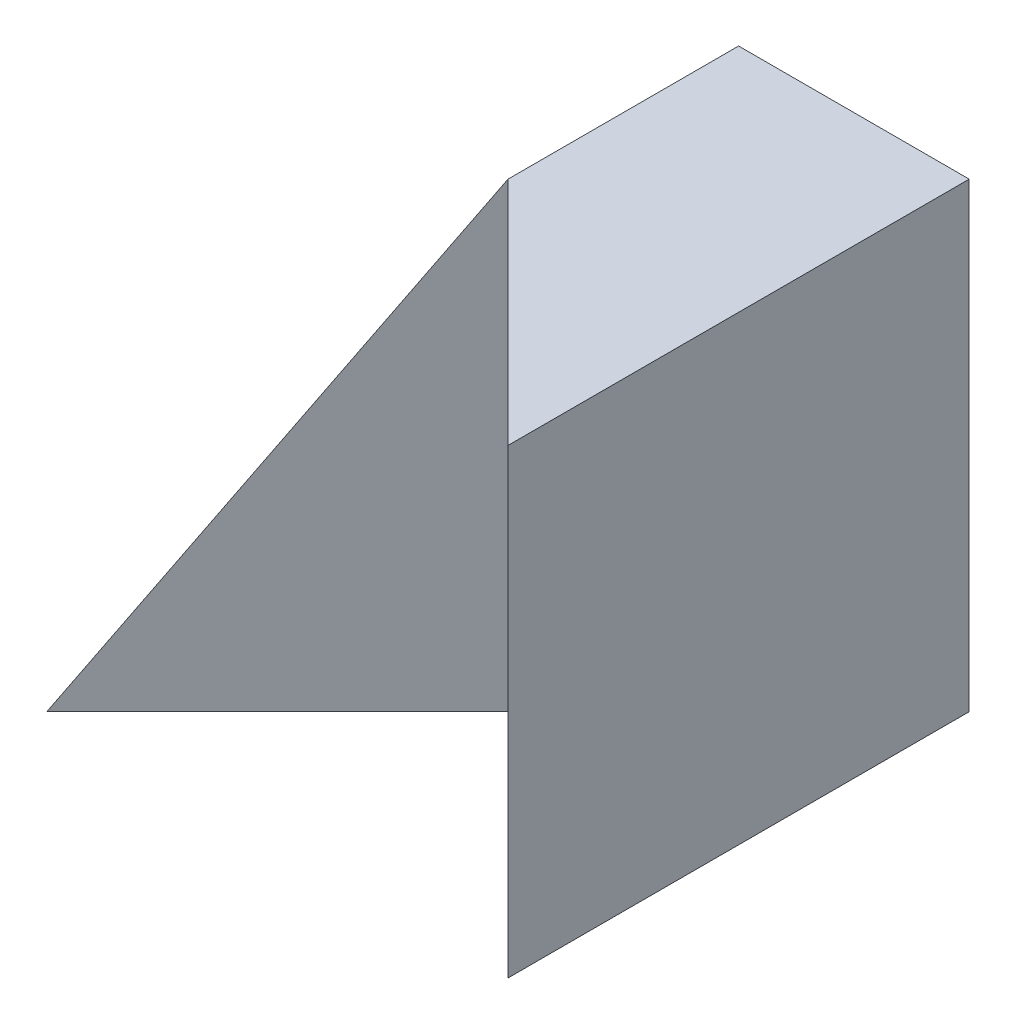
ISO-10303-21;
HEADER;
FILE_DESCRIPTION(('STEP AP214'),'2;1');
FILE_NAME('part.step','',(''),(''),'','','');
FILE_SCHEMA(('AUTOMOTIVE_DESIGN { 1 0 10303 214 1 1 1 1 }'));
ENDSEC;
DATA;
#1=APPLICATION_CONTEXT('core data for automotive mechanical design processes');
#2=APPLICATION_PROTOCOL_DEFINITION('international standard','automotive_design',2000,#1);
#3=PRODUCT_CONTEXT('',#1,'mechanical');
#4=PRODUCT('Part','Part','',(#3));
#5=PRODUCT_RELATED_PRODUCT_CATEGORY('part','',(#4));
#6=PRODUCT_DEFINITION_FORMATION('','',#4);
#7=PRODUCT_DEFINITION_CONTEXT('part definition',#1,'design');
#8=PRODUCT_DEFINITION('design','',#6,#7);
#9=PRODUCT_DEFINITION_SHAPE('','',#8);
#10=(LENGTH_UNIT() NAMED_UNIT(*) SI_UNIT(.MILLI.,.METRE.));
#11=(NAMED_UNIT(*) PLANE_ANGLE_UNIT() SI_UNIT($,.RADIAN.));
#12=(NAMED_UNIT(*) SI_UNIT($,.STERADIAN.) SOLID_ANGLE_UNIT());
#13=UNCERTAINTY_MEASURE_WITH_UNIT(LENGTH_MEASURE(1.E-05),#10,'distance_accuracy_value','');
#14=(GEOMETRIC_REPRESENTATION_CONTEXT(3) GLOBAL_UNCERTAINTY_ASSIGNED_CONTEXT((#13)) GLOBAL_UNIT_ASSIGNED_CONTEXT((#10,
#11,#12)) REPRESENTATION_CONTEXT('',''));
#15=CARTESIAN_POINT('',(0.,0.,0.));
#16=DIRECTION('',(0.,0.,1.));
#17=DIRECTION('',(1.,0.,0.));
#18=AXIS2_PLACEMENT_3D('',#15,#16,#17);
#19=CARTESIAN_POINT('',(0.,0.,40.));
#20=DIRECTION('',(0.,1.,0.));
#21=DIRECTION('',(0.,0.,1.));
#22=AXIS2_PLACEMENT_3D('',#19,#20,#21);
#23=PLANE('',#22);
#24=DIRECTION('',(0.,0.,-1.));
#25=VECTOR('',#24,1.);
#26=CARTESIAN_POINT('',(40.,0.,40.));
#27=LINE('',#26,#25);
#28=CARTESIAN_POINT('',(40.,0.,40.));
#29=VERTEX_POINT('',#28);
#30=CARTESIAN_POINT('',(40.,0.,0.));
#31=VERTEX_POINT('',#30);
#32=EDGE_CURVE('E95',#29,#31,#27,.T.);
#33=ORIENTED_EDGE('',*,*,#32,.F.);
#34=DIRECTION('',(0.707106781186548,0.,0.707106781186547));
#35=VECTOR('',#34,1.);
#36=CARTESIAN_POINT('',(20.,0.,20.));
#37=LINE('',#36,#35);
#38=CARTESIAN_POINT('',(20.,0.,20.));
#39=VERTEX_POINT('',#38);
#40=EDGE_CURVE('E77',#39,#29,#37,.T.);
#41=ORIENTED_EDGE('',*,*,#40,.F.);
#42=DIRECTION('',(0.707106781186548,0.,-0.707106781186547));
#43=VECTOR('',#42,1.);
#44=CARTESIAN_POINT('',(0.,0.,40.));
#45=LINE('',#44,#43);
#46=CARTESIAN_POINT('',(0.,0.,40.));
#47=VERTEX_POINT('',#46);
#48=EDGE_CURVE('E107',#47,#39,#45,.T.);
#49=ORIENTED_EDGE('',*,*,#48,.F.);
#50=DIRECTION('',(0.,0.,-1.));
#51=VECTOR('',#50,1.);
#52=CARTESIAN_POINT('',(0.,0.,40.));
#53=LINE('',#52,#51);
#54=CARTESIAN_POINT('',(0.,0.,0.));
#55=VERTEX_POINT('',#54);
#56=EDGE_CURVE('E40',#47,#55,#53,.T.);
#57=ORIENTED_EDGE('',*,*,#56,.T.);
#58=DIRECTION('',(1.,0.,0.));
#59=VECTOR('',#58,1.);
#60=CARTESIAN_POINT('',(0.,0.,0.));
#61=LINE('',#60,#59);
#62=EDGE_CURVE('E105',#55,#31,#61,.T.);
#63=ORIENTED_EDGE('',*,*,#62,.T.);
#64=EDGE_LOOP('',(#33,#41,#49,#57,#63));
#65=FACE_BOUND('',#64,.T.);
#66=ADVANCED_FACE('F33',(#65),#23,.F.);
#67=CARTESIAN_POINT('',(40.,0.,40.));
#68=DIRECTION('',(-1.,0.,0.));
#69=DIRECTION('',(0.,0.,1.));
#70=AXIS2_PLACEMENT_3D('',#67,#68,#69);
#71=PLANE('',#70);
#72=DIRECTION('',(0.,1.,0.));
#73=VECTOR('',#72,1.);
#74=CARTESIAN_POINT('',(40.,0.,0.));
#75=LINE('',#74,#73);
#76=CARTESIAN_POINT('',(40.,40.,0.));
#77=VERTEX_POINT('',#76);
#78=EDGE_CURVE('E94',#31,#77,#75,.T.);
#79=ORIENTED_EDGE('',*,*,#78,.T.);
#80=DIRECTION('',(0.,0.,-1.));
#81=VECTOR('',#80,1.);
#82=CARTESIAN_POINT('',(40.,40.,40.));
#83=LINE('',#82,#81);
#84=CARTESIAN_POINT('',(40.,40.,40.));
#85=VERTEX_POINT('',#84);
#86=EDGE_CURVE('E82',#85,#77,#83,.T.);
#87=ORIENTED_EDGE('',*,*,#86,.F.);
#88=DIRECTION('',(0.,1.,0.));
#89=VECTOR('',#88,1.);
#90=CARTESIAN_POINT('',(40.,0.,40.));
#91=LINE('',#90,#89);
#92=EDGE_CURVE('E74',#29,#85,#91,.T.);
#93=ORIENTED_EDGE('',*,*,#92,.F.);
#94=ORIENTED_EDGE('',*,*,#32,.T.);
#95=EDGE_LOOP('',(#79,#87,#93,#94));
#96=FACE_BOUND('',#95,.T.);
#97=ADVANCED_FACE('F92',(#96),#71,.F.);
#98=CARTESIAN_POINT('',(0.,40.,40.));
#99=DIRECTION('',(0.,-1.,0.));
#100=DIRECTION('',(0.,0.,-1.));
#101=AXIS2_PLACEMENT_3D('',#98,#99,#100);
#102=PLANE('',#101);
#103=DIRECTION('',(0.,0.,1.));
#104=VECTOR('',#103,1.);
#105=CARTESIAN_POINT('',(20.,40.,0.));
#106=LINE('',#105,#104);
#107=CARTESIAN_POINT('',(20.,40.,0.));
#108=VERTEX_POINT('',#107);
#109=CARTESIAN_POINT('',(20.,40.,20.));
#110=VERTEX_POINT('',#109);
#111=EDGE_CURVE('E54',#108,#110,#106,.T.);
#112=ORIENTED_EDGE('',*,*,#111,.T.);
#113=DIRECTION('',(0.707106781186548,0.,0.707106781186547));
#114=VECTOR('',#113,1.);
#115=CARTESIAN_POINT('',(20.,40.,20.));
#116=LINE('',#115,#114);
#117=EDGE_CURVE('E47',#110,#85,#116,.T.);
#118=ORIENTED_EDGE('',*,*,#117,.T.);
#119=ORIENTED_EDGE('',*,*,#86,.T.);
#120=DIRECTION('',(-1.,0.,0.));
#121=VECTOR('',#120,1.);
#122=CARTESIAN_POINT('',(0.,40.,0.));
#123=LINE('',#122,#121);
#124=EDGE_CURVE('E83',#77,#108,#123,.T.);
#125=ORIENTED_EDGE('',*,*,#124,.T.);
#126=EDGE_LOOP('',(#112,#118,#119,#125));
#127=FACE_BOUND('',#126,.T.);
#128=ADVANCED_FACE('F87',(#127),#102,.F.);
#129=CARTESIAN_POINT('',(0.,0.,0.));
#130=DIRECTION('',(0.,0.,-1.));
#131=DIRECTION('',(-1.,0.,0.));
#132=AXIS2_PLACEMENT_3D('',#129,#130,#131);
#133=PLANE('',#132);
#134=DIRECTION('',(0.447213595499958,0.894427190999916,0.));
#135=VECTOR('',#134,1.);
#136=CARTESIAN_POINT('',(0.,0.,0.));
#137=LINE('',#136,#135);
#138=EDGE_CURVE('E109',#55,#108,#137,.T.);
#139=ORIENTED_EDGE('',*,*,#138,.T.);
#140=ORIENTED_EDGE('',*,*,#124,.F.);
#141=ORIENTED_EDGE('',*,*,#78,.F.);
#142=ORIENTED_EDGE('',*,*,#62,.F.);
#143=EDGE_LOOP('',(#139,#140,#141,#142));
#144=FACE_BOUND('',#143,.T.);
#145=ADVANCED_FACE('F112',(#144),#133,.T.);
#146=CARTESIAN_POINT('',(0.,0.,0.));
#147=DIRECTION('',(0.894427190999916,-0.447213595499958,0.));
#148=DIRECTION('',(0.447213595499958,0.894427190999916,0.));
#149=AXIS2_PLACEMENT_3D('',#146,#147,#148);
#150=PLANE('',#149);
#151=ORIENTED_EDGE('',*,*,#56,.F.);
#152=DIRECTION('',(0.408248290463863,0.816496580927726,-0.408248290463863));
#153=VECTOR('',#152,1.);
#154=CARTESIAN_POINT('',(6.66666666666667,13.3333333333333,33.3333333333333));
#155=LINE('',#154,#153);
#156=EDGE_CURVE('E11',#47,#110,#155,.T.);
#157=ORIENTED_EDGE('',*,*,#156,.T.);
#158=ORIENTED_EDGE('',*,*,#111,.F.);
#159=ORIENTED_EDGE('',*,*,#138,.F.);
#160=EDGE_LOOP('',(#151,#157,#158,#159));
#161=FACE_BOUND('',#160,.T.);
#162=ADVANCED_FACE('F108',(#161),#150,.F.);
#163=CARTESIAN_POINT('',(0.,40.,40.));
#164=DIRECTION('',(-0.707106781186547,0.,-0.707106781186548));
#165=DIRECTION('',(-0.707106781186548,0.,0.707106781186547));
#166=AXIS2_PLACEMENT_3D('',#163,#164,#165);
#167=PLANE('',#166);
#168=ORIENTED_EDGE('',*,*,#48,.T.);
#169=DIRECTION('',(0.,-1.,0.));
#170=VECTOR('',#169,1.);
#171=CARTESIAN_POINT('',(20.,40.,20.));
#172=LINE('',#171,#170);
#173=EDGE_CURVE('E90',#110,#39,#172,.T.);
#174=ORIENTED_EDGE('',*,*,#173,.F.);
#175=ORIENTED_EDGE('',*,*,#156,.F.);
#176=EDGE_LOOP('',(#168,#174,#175));
#177=FACE_BOUND('',#176,.T.);
#178=ADVANCED_FACE('F119',(#177),#167,.F.);
#179=CARTESIAN_POINT('',(20.,40.,20.));
#180=DIRECTION('',(0.707106781186547,0.,-0.707106781186548));
#181=DIRECTION('',(-0.707106781186548,0.,-0.707106781186547));
#182=AXIS2_PLACEMENT_3D('',#179,#180,#181);
#183=PLANE('',#182);
#184=ORIENTED_EDGE('',*,*,#40,.T.);
#185=ORIENTED_EDGE('',*,*,#92,.T.);
#186=ORIENTED_EDGE('',*,*,#117,.F.);
#187=ORIENTED_EDGE('',*,*,#173,.T.);
#188=EDGE_LOOP('',(#184,#185,#186,#187));
#189=FACE_BOUND('',#188,.T.);
#190=ADVANCED_FACE('F75',(#189),#183,.F.);
#191=CLOSED_SHELL('',(#66,#97,#128,#145,#162,#178,#190));
#192=MANIFOLD_SOLID_BREP('B2',#191);
#193=ADVANCED_BREP_SHAPE_REPRESENTATION('',(#18,#192),#14);
#194=SHAPE_DEFINITION_REPRESENTATION(#9,#193);
ENDSEC;
END-ISO-10303-21;
